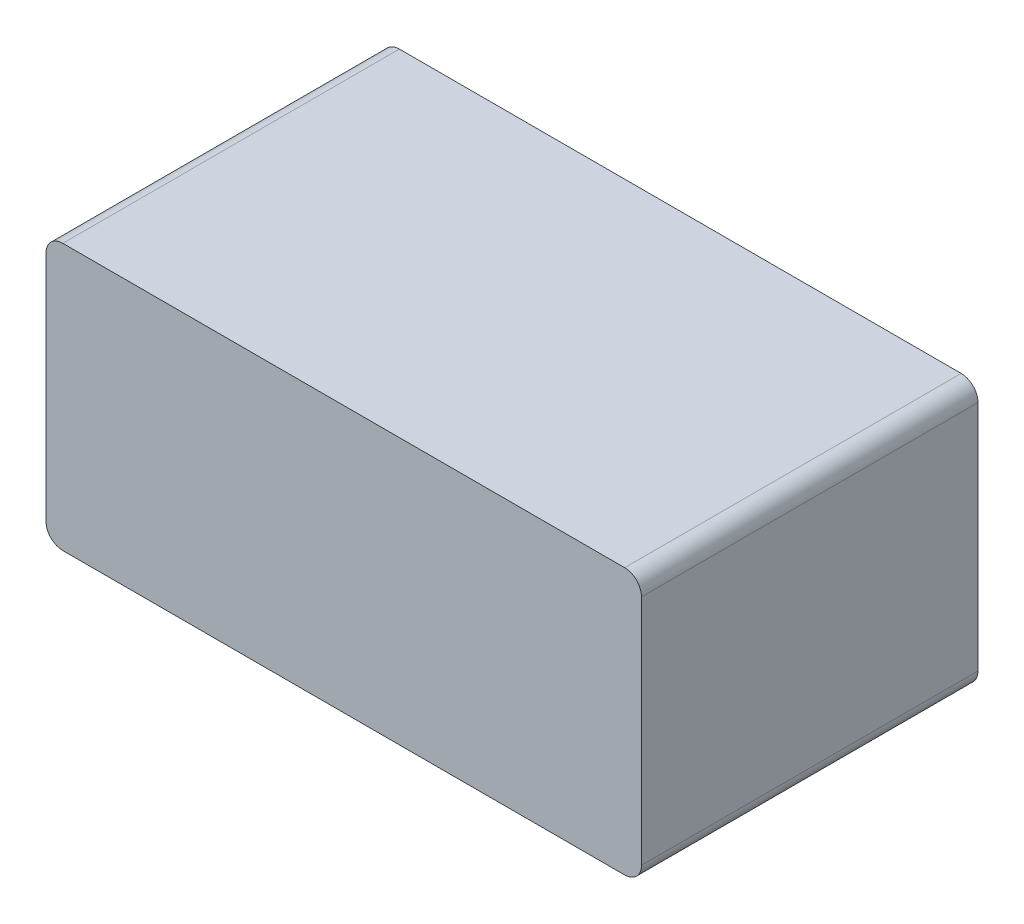
ISO-10303-21;
HEADER;
FILE_DESCRIPTION(('STEP AP214'),'2;1');
FILE_NAME('part.step','',(''),(''),'','','');
FILE_SCHEMA(('AUTOMOTIVE_DESIGN { 1 0 10303 214 1 1 1 1 }'));
ENDSEC;
DATA;
#1=APPLICATION_CONTEXT('core data for automotive mechanical design processes');
#2=APPLICATION_PROTOCOL_DEFINITION('international standard','automotive_design',2000,#1);
#3=PRODUCT_CONTEXT('',#1,'mechanical');
#4=PRODUCT('Part','Part','',(#3));
#5=PRODUCT_RELATED_PRODUCT_CATEGORY('part','',(#4));
#6=PRODUCT_DEFINITION_FORMATION('','',#4);
#7=PRODUCT_DEFINITION_CONTEXT('part definition',#1,'design');
#8=PRODUCT_DEFINITION('design','',#6,#7);
#9=PRODUCT_DEFINITION_SHAPE('','',#8);
#10=(LENGTH_UNIT() NAMED_UNIT(*) SI_UNIT(.MILLI.,.METRE.));
#11=(NAMED_UNIT(*) PLANE_ANGLE_UNIT() SI_UNIT($,.RADIAN.));
#12=(NAMED_UNIT(*) SI_UNIT($,.STERADIAN.) SOLID_ANGLE_UNIT());
#13=UNCERTAINTY_MEASURE_WITH_UNIT(LENGTH_MEASURE(1.E-05),#10,'distance_accuracy_value','');
#14=(GEOMETRIC_REPRESENTATION_CONTEXT(3) GLOBAL_UNCERTAINTY_ASSIGNED_CONTEXT((#13)) GLOBAL_UNIT_ASSIGNED_CONTEXT((#10,
#11,#12)) REPRESENTATION_CONTEXT('',''));
#15=CARTESIAN_POINT('',(0.,0.,0.));
#16=DIRECTION('',(0.,0.,1.));
#17=DIRECTION('',(1.,0.,0.));
#18=AXIS2_PLACEMENT_3D('',#15,#16,#17);
#19=CARTESIAN_POINT('',(15.0107187747532,-12.9475380060647,-2.));
#20=DIRECTION('',(0.,0.,1.));
#21=DIRECTION('',(1.,0.,0.));
#22=AXIS2_PLACEMENT_3D('',#19,#20,#21);
#23=CYLINDRICAL_SURFACE('',#22,0.0999999999999994);
#24=CARTESIAN_POINT('',(15.0107187747532,-12.9475380060647,-2.));
#25=DIRECTION('',(0.,0.,1.));
#26=DIRECTION('',(1.,0.,0.));
#27=AXIS2_PLACEMENT_3D('',#24,#25,#26);
#28=CIRCLE('',#27,0.0999999999999994);
#29=CARTESIAN_POINT('',(15.0107187747532,-13.0475380060647,-2.));
#30=VERTEX_POINT('',#29);
#31=CARTESIAN_POINT('',(15.1107187747532,-12.9475380060647,-2.));
#32=VERTEX_POINT('',#31);
#33=EDGE_CURVE('E88',#30,#32,#28,.T.);
#34=ORIENTED_EDGE('',*,*,#33,.T.);
#35=DIRECTION('',(0.,0.,-1.));
#36=VECTOR('',#35,1.);
#37=CARTESIAN_POINT('',(15.1107187747532,-12.9475380060647,-2.));
#38=LINE('',#37,#36);
#39=CARTESIAN_POINT('',(15.1107187747532,-12.9475380060647,0.));
#40=VERTEX_POINT('',#39);
#41=EDGE_CURVE('E86',#40,#32,#38,.T.);
#42=ORIENTED_EDGE('',*,*,#41,.F.);
#43=CARTESIAN_POINT('',(15.0107187747532,-12.9475380060647,0.));
#44=DIRECTION('',(0.,0.,1.));
#45=DIRECTION('',(1.,0.,0.));
#46=AXIS2_PLACEMENT_3D('',#43,#44,#45);
#47=CIRCLE('',#46,0.0999999999999994);
#48=CARTESIAN_POINT('',(15.0107187747532,-13.0475380060647,0.));
#49=VERTEX_POINT('',#48);
#50=EDGE_CURVE('E20',#40,#49,#47,.F.);
#51=ORIENTED_EDGE('',*,*,#50,.T.);
#52=DIRECTION('',(0.,0.,-1.));
#53=VECTOR('',#52,1.);
#54=CARTESIAN_POINT('',(15.0107187747532,-13.0475380060647,-2.));
#55=LINE('',#54,#53);
#56=EDGE_CURVE('E83',#30,#49,#55,.F.);
#57=ORIENTED_EDGE('',*,*,#56,.F.);
#58=EDGE_LOOP('',(#34,#42,#51,#57));
#59=FACE_BOUND('',#58,.T.);
#60=ADVANCED_FACE('F17',(#59),#23,.T.);
#61=CARTESIAN_POINT('',(11.6713210973367,-12.9475380060647,-2.));
#62=DIRECTION('',(0.,0.,1.));
#63=DIRECTION('',(1.,0.,0.));
#64=AXIS2_PLACEMENT_3D('',#61,#62,#63);
#65=CYLINDRICAL_SURFACE('',#64,0.0999999999999994);
#66=CARTESIAN_POINT('',(11.6713210973367,-12.9475380060647,-2.));
#67=DIRECTION('',(0.,0.,1.));
#68=DIRECTION('',(1.,0.,0.));
#69=AXIS2_PLACEMENT_3D('',#66,#67,#68);
#70=CIRCLE('',#69,0.0999999999999994);
#71=CARTESIAN_POINT('',(11.5713210973367,-12.9475380060647,-2.));
#72=VERTEX_POINT('',#71);
#73=CARTESIAN_POINT('',(11.6713210973367,-13.0475380060647,-2.));
#74=VERTEX_POINT('',#73);
#75=EDGE_CURVE('E124',#72,#74,#70,.T.);
#76=ORIENTED_EDGE('',*,*,#75,.T.);
#77=DIRECTION('',(0.,0.,-1.));
#78=VECTOR('',#77,1.);
#79=CARTESIAN_POINT('',(11.6713210973367,-13.0475380060647,-2.));
#80=LINE('',#79,#78);
#81=CARTESIAN_POINT('',(11.6713210973367,-13.0475380060647,0.));
#82=VERTEX_POINT('',#81);
#83=EDGE_CURVE('E97',#82,#74,#80,.T.);
#84=ORIENTED_EDGE('',*,*,#83,.F.);
#85=CARTESIAN_POINT('',(11.6713210973367,-12.9475380060647,0.));
#86=DIRECTION('',(0.,0.,1.));
#87=DIRECTION('',(1.,0.,0.));
#88=AXIS2_PLACEMENT_3D('',#85,#86,#87);
#89=CIRCLE('',#88,0.0999999999999994);
#90=CARTESIAN_POINT('',(11.5713210973367,-12.9475380060647,0.));
#91=VERTEX_POINT('',#90);
#92=EDGE_CURVE('E102',#82,#91,#89,.F.);
#93=ORIENTED_EDGE('',*,*,#92,.T.);
#94=DIRECTION('',(0.,0.,1.));
#95=VECTOR('',#94,1.);
#96=CARTESIAN_POINT('',(11.5713210973367,-12.9475380060647,-2.));
#97=LINE('',#96,#95);
#98=EDGE_CURVE('E96',#72,#91,#97,.T.);
#99=ORIENTED_EDGE('',*,*,#98,.F.);
#100=EDGE_LOOP('',(#76,#84,#93,#99));
#101=FACE_BOUND('',#100,.T.);
#102=ADVANCED_FACE('F159',(#101),#65,.T.);
#103=CARTESIAN_POINT('',(15.1107187747532,-11.5659567604475,-2.));
#104=DIRECTION('',(1.,0.,0.));
#105=DIRECTION('',(0.,0.,-1.));
#106=AXIS2_PLACEMENT_3D('',#103,#104,#105);
#107=PLANE('',#106);
#108=DIRECTION('',(0.,1.,0.));
#109=VECTOR('',#108,1.);
#110=CARTESIAN_POINT('',(15.1107187747532,-11.5659567604475,-2.));
#111=LINE('',#110,#109);
#112=CARTESIAN_POINT('',(15.1107187747532,-11.5659567604475,-2.));
#113=VERTEX_POINT('',#112);
#114=EDGE_CURVE('E120',#32,#113,#111,.T.);
#115=ORIENTED_EDGE('',*,*,#114,.T.);
#116=DIRECTION('',(0.,0.,1.));
#117=VECTOR('',#116,1.);
#118=CARTESIAN_POINT('',(15.1107187747532,-11.5659567604475,-2.));
#119=LINE('',#118,#117);
#120=CARTESIAN_POINT('',(15.1107187747532,-11.5659567604475,0.));
#121=VERTEX_POINT('',#120);
#122=EDGE_CURVE('E116',#121,#113,#119,.F.);
#123=ORIENTED_EDGE('',*,*,#122,.F.);
#124=DIRECTION('',(0.,1.,0.));
#125=VECTOR('',#124,1.);
#126=CARTESIAN_POINT('',(15.1107187747532,-12.9475380060647,0.));
#127=LINE('',#126,#125);
#128=EDGE_CURVE('E104',#40,#121,#127,.T.);
#129=ORIENTED_EDGE('',*,*,#128,.F.);
#130=ORIENTED_EDGE('',*,*,#41,.T.);
#131=EDGE_LOOP('',(#115,#123,#129,#130));
#132=FACE_BOUND('',#131,.T.);
#133=ADVANCED_FACE('F140',(#132),#107,.T.);
#134=CARTESIAN_POINT('',(11.6713210973367,-13.0475380060647,-2.));
#135=DIRECTION('',(0.,-1.,0.));
#136=DIRECTION('',(0.,0.,-1.));
#137=AXIS2_PLACEMENT_3D('',#134,#135,#136);
#138=PLANE('',#137);
#139=DIRECTION('',(1.,0.,0.));
#140=VECTOR('',#139,1.);
#141=CARTESIAN_POINT('',(11.6713210973367,-13.0475380060647,-2.));
#142=LINE('',#141,#140);
#143=EDGE_CURVE('E95',#74,#30,#142,.T.);
#144=ORIENTED_EDGE('',*,*,#143,.T.);
#145=ORIENTED_EDGE('',*,*,#56,.T.);
#146=DIRECTION('',(1.,0.,0.));
#147=VECTOR('',#146,1.);
#148=CARTESIAN_POINT('',(11.6713210973367,-13.0475380060647,0.));
#149=LINE('',#148,#147);
#150=EDGE_CURVE('E93',#82,#49,#149,.T.);
#151=ORIENTED_EDGE('',*,*,#150,.F.);
#152=ORIENTED_EDGE('',*,*,#83,.T.);
#153=EDGE_LOOP('',(#144,#145,#151,#152));
#154=FACE_BOUND('',#153,.T.);
#155=ADVANCED_FACE('F91',(#154),#138,.T.);
#156=CARTESIAN_POINT('',(11.5713210973367,-11.5659567604475,-2.));
#157=DIRECTION('',(-1.,0.,0.));
#158=DIRECTION('',(0.,0.,1.));
#159=AXIS2_PLACEMENT_3D('',#156,#157,#158);
#160=PLANE('',#159);
#161=DIRECTION('',(0.,1.,0.));
#162=VECTOR('',#161,1.);
#163=CARTESIAN_POINT('',(11.5713210973367,-12.9475380060647,-2.));
#164=LINE('',#163,#162);
#165=CARTESIAN_POINT('',(11.5713210973367,-11.5659567604475,-2.));
#166=VERTEX_POINT('',#165);
#167=EDGE_CURVE('E129',#166,#72,#164,.F.);
#168=ORIENTED_EDGE('',*,*,#167,.T.);
#169=ORIENTED_EDGE('',*,*,#98,.T.);
#170=DIRECTION('',(0.,1.,0.));
#171=VECTOR('',#170,1.);
#172=CARTESIAN_POINT('',(11.5713210973367,-12.9475380060647,0.));
#173=LINE('',#172,#171);
#174=CARTESIAN_POINT('',(11.5713210973367,-11.5659567604475,0.));
#175=VERTEX_POINT('',#174);
#176=EDGE_CURVE('E106',#175,#91,#173,.F.);
#177=ORIENTED_EDGE('',*,*,#176,.F.);
#178=DIRECTION('',(0.,0.,1.));
#179=VECTOR('',#178,1.);
#180=CARTESIAN_POINT('',(11.5713210973367,-11.5659567604475,-2.));
#181=LINE('',#180,#179);
#182=EDGE_CURVE('E112',#166,#175,#181,.T.);
#183=ORIENTED_EDGE('',*,*,#182,.F.);
#184=EDGE_LOOP('',(#168,#169,#177,#183));
#185=FACE_BOUND('',#184,.T.);
#186=ADVANCED_FACE('F156',(#185),#160,.T.);
#187=CARTESIAN_POINT('',(11.6713210973367,-12.9475380060647,0.));
#188=DIRECTION('',(0.,0.,1.));
#189=DIRECTION('',(1.,0.,0.));
#190=AXIS2_PLACEMENT_3D('',#187,#188,#189);
#191=PLANE('',#190);
#192=CARTESIAN_POINT('',(11.6713210973367,-11.5659567604475,0.));
#193=DIRECTION('',(0.,0.,1.));
#194=DIRECTION('',(1.,0.,0.));
#195=AXIS2_PLACEMENT_3D('',#192,#193,#194);
#196=CIRCLE('',#195,0.0999999999999994);
#197=CARTESIAN_POINT('',(11.6713210973367,-11.4659567604475,0.));
#198=VERTEX_POINT('',#197);
#199=EDGE_CURVE('E126',#175,#198,#196,.F.);
#200=ORIENTED_EDGE('',*,*,#199,.F.);
#201=ORIENTED_EDGE('',*,*,#176,.T.);
#202=ORIENTED_EDGE('',*,*,#92,.F.);
#203=ORIENTED_EDGE('',*,*,#150,.T.);
#204=ORIENTED_EDGE('',*,*,#50,.F.);
#205=ORIENTED_EDGE('',*,*,#128,.T.);
#206=CARTESIAN_POINT('',(15.0107187747532,-11.5659567604475,0.));
#207=DIRECTION('',(0.,0.,1.));
#208=DIRECTION('',(1.,0.,0.));
#209=AXIS2_PLACEMENT_3D('',#206,#207,#208);
#210=CIRCLE('',#209,0.0999999999999994);
#211=CARTESIAN_POINT('',(15.0107187747532,-11.4659567604475,0.));
#212=VERTEX_POINT('',#211);
#213=EDGE_CURVE('E119',#212,#121,#210,.F.);
#214=ORIENTED_EDGE('',*,*,#213,.F.);
#215=DIRECTION('',(1.,0.,0.));
#216=VECTOR('',#215,1.);
#217=CARTESIAN_POINT('',(11.6713210973367,-11.4659567604475,0.));
#218=LINE('',#217,#216);
#219=EDGE_CURVE('E114',#198,#212,#218,.T.);
#220=ORIENTED_EDGE('',*,*,#219,.F.);
#221=EDGE_LOOP('',(#200,#201,#202,#203,#204,#205,#214,#220));
#222=FACE_BOUND('',#221,.T.);
#223=ADVANCED_FACE('F100',(#222),#191,.T.);
#224=CARTESIAN_POINT('',(15.0107187747532,-11.5659567604475,-2.));
#225=DIRECTION('',(0.,0.,1.));
#226=DIRECTION('',(1.,0.,0.));
#227=AXIS2_PLACEMENT_3D('',#224,#225,#226);
#228=CYLINDRICAL_SURFACE('',#227,0.0999999999999994);
#229=CARTESIAN_POINT('',(15.0107187747532,-11.5659567604475,-2.));
#230=DIRECTION('',(0.,0.,1.));
#231=DIRECTION('',(1.,0.,0.));
#232=AXIS2_PLACEMENT_3D('',#229,#230,#231);
#233=CIRCLE('',#232,0.0999999999999994);
#234=CARTESIAN_POINT('',(15.0107187747532,-11.4659567604475,-2.));
#235=VERTEX_POINT('',#234);
#236=EDGE_CURVE('E130',#113,#235,#233,.T.);
#237=ORIENTED_EDGE('',*,*,#236,.T.);
#238=DIRECTION('',(0.,0.,1.));
#239=VECTOR('',#238,1.);
#240=CARTESIAN_POINT('',(15.0107187747532,-11.4659567604475,-2.));
#241=LINE('',#240,#239);
#242=EDGE_CURVE('E145',#212,#235,#241,.F.);
#243=ORIENTED_EDGE('',*,*,#242,.F.);
#244=ORIENTED_EDGE('',*,*,#213,.T.);
#245=ORIENTED_EDGE('',*,*,#122,.T.);
#246=EDGE_LOOP('',(#237,#243,#244,#245));
#247=FACE_BOUND('',#246,.T.);
#248=ADVANCED_FACE('F146',(#247),#228,.T.);
#249=CARTESIAN_POINT('',(11.6713210973367,-12.9475380060647,-2.));
#250=DIRECTION('',(0.,0.,1.));
#251=DIRECTION('',(1.,0.,0.));
#252=AXIS2_PLACEMENT_3D('',#249,#250,#251);
#253=PLANE('',#252);
#254=ORIENTED_EDGE('',*,*,#167,.F.);
#255=CARTESIAN_POINT('',(11.6713210973367,-11.5659567604475,-2.));
#256=DIRECTION('',(0.,0.,1.));
#257=DIRECTION('',(1.,0.,0.));
#258=AXIS2_PLACEMENT_3D('',#255,#256,#257);
#259=CIRCLE('',#258,0.0999999999999994);
#260=CARTESIAN_POINT('',(11.6713210973367,-11.4659567604475,-2.));
#261=VERTEX_POINT('',#260);
#262=EDGE_CURVE('E35',#261,#166,#259,.T.);
#263=ORIENTED_EDGE('',*,*,#262,.F.);
#264=DIRECTION('',(1.,0.,0.));
#265=VECTOR('',#264,1.);
#266=CARTESIAN_POINT('',(11.6713210973367,-11.4659567604475,-2.));
#267=LINE('',#266,#265);
#268=EDGE_CURVE('E26',#235,#261,#267,.F.);
#269=ORIENTED_EDGE('',*,*,#268,.F.);
#270=ORIENTED_EDGE('',*,*,#236,.F.);
#271=ORIENTED_EDGE('',*,*,#114,.F.);
#272=ORIENTED_EDGE('',*,*,#33,.F.);
#273=ORIENTED_EDGE('',*,*,#143,.F.);
#274=ORIENTED_EDGE('',*,*,#75,.F.);
#275=EDGE_LOOP('',(#254,#263,#269,#270,#271,#272,#273,#274));
#276=FACE_BOUND('',#275,.T.);
#277=ADVANCED_FACE('F137',(#276),#253,.F.);
#278=CARTESIAN_POINT('',(11.6713210973367,-11.5659567604475,-2.));
#279=DIRECTION('',(0.,0.,1.));
#280=DIRECTION('',(1.,0.,0.));
#281=AXIS2_PLACEMENT_3D('',#278,#279,#280);
#282=CYLINDRICAL_SURFACE('',#281,0.0999999999999994);
#283=ORIENTED_EDGE('',*,*,#262,.T.);
#284=ORIENTED_EDGE('',*,*,#182,.T.);
#285=ORIENTED_EDGE('',*,*,#199,.T.);
#286=DIRECTION('',(0.,0.,1.));
#287=VECTOR('',#286,1.);
#288=CARTESIAN_POINT('',(11.6713210973367,-11.4659567604475,-2.));
#289=LINE('',#288,#287);
#290=EDGE_CURVE('E11',#261,#198,#289,.T.);
#291=ORIENTED_EDGE('',*,*,#290,.F.);
#292=EDGE_LOOP('',(#283,#284,#285,#291));
#293=FACE_BOUND('',#292,.T.);
#294=ADVANCED_FACE('F170',(#293),#282,.T.);
#295=CARTESIAN_POINT('',(11.6713210973367,-11.4659567604475,-2.));
#296=DIRECTION('',(0.,1.,0.));
#297=DIRECTION('',(0.,0.,1.));
#298=AXIS2_PLACEMENT_3D('',#295,#296,#297);
#299=PLANE('',#298);
#300=ORIENTED_EDGE('',*,*,#268,.T.);
#301=ORIENTED_EDGE('',*,*,#290,.T.);
#302=ORIENTED_EDGE('',*,*,#219,.T.);
#303=ORIENTED_EDGE('',*,*,#242,.T.);
#304=EDGE_LOOP('',(#300,#301,#302,#303));
#305=FACE_BOUND('',#304,.T.);
#306=ADVANCED_FACE('F150',(#305),#299,.T.);
#307=CLOSED_SHELL('',(#60,#102,#133,#155,#186,#223,#248,#277,#294,#306));
#308=MANIFOLD_SOLID_BREP('B1',#307);
#309=ADVANCED_BREP_SHAPE_REPRESENTATION('',(#18,#308),#14);
#310=SHAPE_DEFINITION_REPRESENTATION(#9,#309);
ENDSEC;
END-ISO-10303-21;
